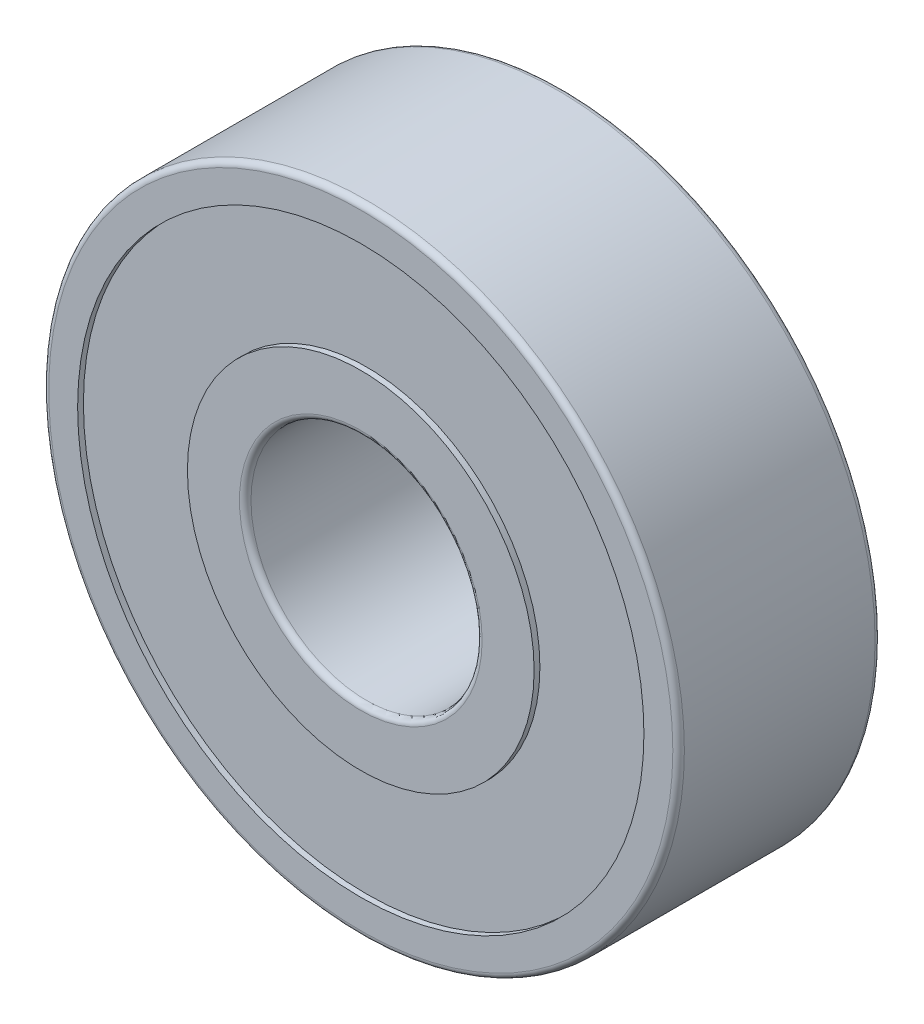
ISO-10303-21;
HEADER;
FILE_DESCRIPTION(('STEP AP214'),'2;1');
FILE_NAME('part.step','',(''),(''),'','','');
FILE_SCHEMA(('AUTOMOTIVE_DESIGN { 1 0 10303 214 1 1 1 1 }'));
ENDSEC;
DATA;
#1=APPLICATION_CONTEXT('core data for automotive mechanical design processes');
#2=APPLICATION_PROTOCOL_DEFINITION('international standard','automotive_design',2000,#1);
#3=PRODUCT_CONTEXT('',#1,'mechanical');
#4=PRODUCT('Part','Part','',(#3));
#5=PRODUCT_RELATED_PRODUCT_CATEGORY('part','',(#4));
#6=PRODUCT_DEFINITION_FORMATION('','',#4);
#7=PRODUCT_DEFINITION_CONTEXT('part definition',#1,'design');
#8=PRODUCT_DEFINITION('design','',#6,#7);
#9=PRODUCT_DEFINITION_SHAPE('','',#8);
#10=(LENGTH_UNIT() NAMED_UNIT(*) SI_UNIT(.MILLI.,.METRE.));
#11=(NAMED_UNIT(*) PLANE_ANGLE_UNIT() SI_UNIT($,.RADIAN.));
#12=(NAMED_UNIT(*) SI_UNIT($,.STERADIAN.) SOLID_ANGLE_UNIT());
#13=UNCERTAINTY_MEASURE_WITH_UNIT(LENGTH_MEASURE(1.E-05),#10,'distance_accuracy_value','');
#14=(GEOMETRIC_REPRESENTATION_CONTEXT(3) GLOBAL_UNCERTAINTY_ASSIGNED_CONTEXT((#13)) GLOBAL_UNIT_ASSIGNED_CONTEXT((#10,
#11,#12)) REPRESENTATION_CONTEXT('',''));
#15=CARTESIAN_POINT('',(0.,0.,0.));
#16=DIRECTION('',(0.,0.,1.));
#17=DIRECTION('',(1.,0.,0.));
#18=AXIS2_PLACEMENT_3D('',#15,#16,#17);
#19=CARTESIAN_POINT('',(0.,0.,0.));
#20=DIRECTION('',(0.,0.,-1.));
#21=DIRECTION('',(1.,0.,0.));
#22=AXIS2_PLACEMENT_3D('',#19,#20,#21);
#23=PLANE('',#22);
#24=CARTESIAN_POINT('',(0.,0.,0.));
#25=DIRECTION('',(0.,0.,1.));
#26=DIRECTION('',(1.,0.,0.));
#27=AXIS2_PLACEMENT_3D('',#24,#25,#26);
#28=CIRCLE('',#27,4.2);
#29=CARTESIAN_POINT('',(4.2,0.,0.));
#30=VERTEX_POINT('',#29);
#31=EDGE_CURVE('E64',#30,#30,#28,.T.);
#32=ORIENTED_EDGE('',*,*,#31,.F.);
#33=EDGE_LOOP('',(#32));
#34=FACE_BOUND('',#33,.T.);
#35=CARTESIAN_POINT('',(0.,0.,0.));
#36=DIRECTION('',(0.,0.,1.));
#37=DIRECTION('',(1.,0.,0.));
#38=AXIS2_PLACEMENT_3D('',#35,#36,#37);
#39=CIRCLE('',#38,6.);
#40=CARTESIAN_POINT('',(6.,0.,0.));
#41=VERTEX_POINT('',#40);
#42=EDGE_CURVE('E86',#41,#41,#39,.T.);
#43=ORIENTED_EDGE('',*,*,#42,.T.);
#44=EDGE_LOOP('',(#43));
#45=FACE_BOUND('',#44,.T.);
#46=ADVANCED_FACE('F35',(#34,#45),#23,.F.);
#47=CARTESIAN_POINT('',(0.,0.,-7.));
#48=DIRECTION('',(0.,0.,-1.));
#49=DIRECTION('',(1.,0.,0.));
#50=AXIS2_PLACEMENT_3D('',#47,#48,#49);
#51=PLANE('',#50);
#52=CARTESIAN_POINT('',(0.,0.,-7.));
#53=DIRECTION('',(0.,0.,1.));
#54=DIRECTION('',(1.,0.,0.));
#55=AXIS2_PLACEMENT_3D('',#52,#53,#54);
#56=CIRCLE('',#55,4.2);
#57=CARTESIAN_POINT('',(4.2,0.,-7.));
#58=VERTEX_POINT('',#57);
#59=EDGE_CURVE('E55',#58,#58,#56,.F.);
#60=ORIENTED_EDGE('',*,*,#59,.F.);
#61=EDGE_LOOP('',(#60));
#62=FACE_BOUND('',#61,.T.);
#63=CARTESIAN_POINT('',(0.,0.,-7.));
#64=DIRECTION('',(0.,0.,1.));
#65=DIRECTION('',(1.,0.,0.));
#66=AXIS2_PLACEMENT_3D('',#63,#64,#65);
#67=CIRCLE('',#66,6.);
#68=CARTESIAN_POINT('',(6.,0.,-7.));
#69=VERTEX_POINT('',#68);
#70=EDGE_CURVE('E74',#69,#69,#67,.T.);
#71=ORIENTED_EDGE('',*,*,#70,.F.);
#72=EDGE_LOOP('',(#71));
#73=FACE_BOUND('',#72,.T.);
#74=ADVANCED_FACE('F112',(#62,#73),#51,.T.);
#75=CARTESIAN_POINT('',(0.,0.,-7.));
#76=DIRECTION('',(0.,0.,1.));
#77=DIRECTION('',(1.,0.,0.));
#78=AXIS2_PLACEMENT_3D('',#75,#76,#77);
#79=CIRCLE('',#78,10.8);
#80=CARTESIAN_POINT('',(10.8,0.,-7.));
#81=VERTEX_POINT('',#80);
#82=EDGE_CURVE('E10',#81,#81,#79,.T.);
#83=ORIENTED_EDGE('',*,*,#82,.F.);
#84=EDGE_LOOP('',(#83));
#85=FACE_BOUND('',#84,.T.);
#86=CARTESIAN_POINT('',(0.,0.,-7.));
#87=DIRECTION('',(0.,0.,1.));
#88=DIRECTION('',(1.,0.,0.));
#89=AXIS2_PLACEMENT_3D('',#86,#87,#88);
#90=CIRCLE('',#89,9.8);
#91=CARTESIAN_POINT('',(9.8,0.,-7.));
#92=VERTEX_POINT('',#91);
#93=EDGE_CURVE('E68',#92,#92,#90,.T.);
#94=ORIENTED_EDGE('',*,*,#93,.T.);
#95=EDGE_LOOP('',(#94));
#96=FACE_BOUND('',#95,.T.);
#97=ADVANCED_FACE('F119',(#85,#96),#51,.T.);
#98=CARTESIAN_POINT('',(0.,0.,0.));
#99=DIRECTION('',(0.,0.,1.));
#100=DIRECTION('',(1.,0.,0.));
#101=AXIS2_PLACEMENT_3D('',#98,#99,#100);
#102=CIRCLE('',#101,10.8);
#103=CARTESIAN_POINT('',(10.8,0.,0.));
#104=VERTEX_POINT('',#103);
#105=EDGE_CURVE('E42',#104,#104,#102,.F.);
#106=ORIENTED_EDGE('',*,*,#105,.F.);
#107=EDGE_LOOP('',(#106));
#108=FACE_BOUND('',#107,.T.);
#109=CARTESIAN_POINT('',(0.,0.,0.));
#110=DIRECTION('',(0.,0.,1.));
#111=DIRECTION('',(1.,0.,0.));
#112=AXIS2_PLACEMENT_3D('',#109,#110,#111);
#113=CIRCLE('',#112,9.8);
#114=CARTESIAN_POINT('',(9.8,0.,0.));
#115=VERTEX_POINT('',#114);
#116=EDGE_CURVE('E80',#115,#115,#113,.T.);
#117=ORIENTED_EDGE('',*,*,#116,.F.);
#118=EDGE_LOOP('',(#117));
#119=FACE_BOUND('',#118,.T.);
#120=ADVANCED_FACE('F115',(#108,#119),#23,.F.);
#121=CARTESIAN_POINT('',(0.,0.,-7.));
#122=DIRECTION('',(0.,0.,1.));
#123=DIRECTION('',(-1.,0.,0.));
#124=AXIS2_PLACEMENT_3D('',#121,#122,#123);
#125=CYLINDRICAL_SURFACE('',#124,11.);
#126=CARTESIAN_POINT('',(0.,0.,-0.2));
#127=DIRECTION('',(0.,0.,1.));
#128=DIRECTION('',(1.,0.,0.));
#129=AXIS2_PLACEMENT_3D('',#126,#127,#128);
#130=CIRCLE('',#129,11.);
#131=CARTESIAN_POINT('',(11.,0.,-0.2));
#132=VERTEX_POINT('',#131);
#133=EDGE_CURVE('E46',#132,#132,#130,.T.);
#134=ORIENTED_EDGE('',*,*,#133,.F.);
#135=EDGE_LOOP('',(#134));
#136=FACE_BOUND('',#135,.T.);
#137=CARTESIAN_POINT('',(0.,0.,-6.8));
#138=DIRECTION('',(0.,0.,1.));
#139=DIRECTION('',(1.,0.,0.));
#140=AXIS2_PLACEMENT_3D('',#137,#138,#139);
#141=CIRCLE('',#140,11.);
#142=CARTESIAN_POINT('',(11.,0.,-6.8));
#143=VERTEX_POINT('',#142);
#144=EDGE_CURVE('E50',#143,#143,#141,.F.);
#145=ORIENTED_EDGE('',*,*,#144,.F.);
#146=EDGE_LOOP('',(#145));
#147=FACE_BOUND('',#146,.T.);
#148=ADVANCED_FACE('F126',(#136,#147),#125,.T.);
#149=CARTESIAN_POINT('',(0.,0.,-7.));
#150=DIRECTION('',(0.,0.,1.));
#151=DIRECTION('',(-1.,0.,0.));
#152=AXIS2_PLACEMENT_3D('',#149,#150,#151);
#153=CYLINDRICAL_SURFACE('',#152,4.);
#154=CARTESIAN_POINT('',(0.,0.,-0.2));
#155=DIRECTION('',(0.,0.,1.));
#156=DIRECTION('',(1.,0.,0.));
#157=AXIS2_PLACEMENT_3D('',#154,#155,#156);
#158=CIRCLE('',#157,4.);
#159=CARTESIAN_POINT('',(4.,0.,-0.2));
#160=VERTEX_POINT('',#159);
#161=EDGE_CURVE('E58',#160,#160,#158,.F.);
#162=ORIENTED_EDGE('',*,*,#161,.F.);
#163=EDGE_LOOP('',(#162));
#164=FACE_BOUND('',#163,.T.);
#165=CARTESIAN_POINT('',(0.,0.,-6.8));
#166=DIRECTION('',(0.,0.,1.));
#167=DIRECTION('',(1.,0.,0.));
#168=AXIS2_PLACEMENT_3D('',#165,#166,#167);
#169=CIRCLE('',#168,4.);
#170=CARTESIAN_POINT('',(4.,0.,-6.8));
#171=VERTEX_POINT('',#170);
#172=EDGE_CURVE('E61',#171,#171,#169,.T.);
#173=ORIENTED_EDGE('',*,*,#172,.F.);
#174=EDGE_LOOP('',(#173));
#175=FACE_BOUND('',#174,.T.);
#176=ADVANCED_FACE('F132',(#164,#175),#153,.F.);
#177=CARTESIAN_POINT('',(0.,0.,-6.8));
#178=DIRECTION('',(0.,0.,-1.));
#179=DIRECTION('',(1.,0.,0.));
#180=AXIS2_PLACEMENT_3D('',#177,#178,#179);
#181=CYLINDRICAL_SURFACE('',#180,9.8);
#182=CARTESIAN_POINT('',(0.,0.,-6.8));
#183=DIRECTION('',(0.,0.,1.));
#184=DIRECTION('',(1.,0.,0.));
#185=AXIS2_PLACEMENT_3D('',#182,#183,#184);
#186=CIRCLE('',#185,9.8);
#187=CARTESIAN_POINT('',(9.8,0.,-6.8));
#188=VERTEX_POINT('',#187);
#189=EDGE_CURVE('E67',#188,#188,#186,.T.);
#190=ORIENTED_EDGE('',*,*,#189,.T.);
#191=EDGE_LOOP('',(#190));
#192=FACE_BOUND('',#191,.T.);
#193=ORIENTED_EDGE('',*,*,#93,.F.);
#194=EDGE_LOOP('',(#193));
#195=FACE_BOUND('',#194,.T.);
#196=ADVANCED_FACE('F144',(#192,#195),#181,.F.);
#197=CARTESIAN_POINT('',(0.,0.,-6.8));
#198=DIRECTION('',(0.,0.,-1.));
#199=DIRECTION('',(1.,0.,0.));
#200=AXIS2_PLACEMENT_3D('',#197,#198,#199);
#201=PLANE('',#200);
#202=CARTESIAN_POINT('',(0.,0.,-6.8));
#203=DIRECTION('',(0.,0.,1.));
#204=DIRECTION('',(1.,0.,0.));
#205=AXIS2_PLACEMENT_3D('',#202,#203,#204);
#206=CIRCLE('',#205,6.);
#207=CARTESIAN_POINT('',(6.,0.,-6.8));
#208=VERTEX_POINT('',#207);
#209=EDGE_CURVE('E71',#208,#208,#206,.T.);
#210=ORIENTED_EDGE('',*,*,#209,.T.);
#211=EDGE_LOOP('',(#210));
#212=FACE_BOUND('',#211,.T.);
#213=ORIENTED_EDGE('',*,*,#189,.F.);
#214=EDGE_LOOP('',(#213));
#215=FACE_BOUND('',#214,.T.);
#216=ADVANCED_FACE('F107',(#212,#215),#201,.T.);
#217=CARTESIAN_POINT('',(0.,0.,-6.8));
#218=DIRECTION('',(0.,0.,-1.));
#219=DIRECTION('',(1.,0.,0.));
#220=AXIS2_PLACEMENT_3D('',#217,#218,#219);
#221=CYLINDRICAL_SURFACE('',#220,6.);
#222=ORIENTED_EDGE('',*,*,#209,.F.);
#223=EDGE_LOOP('',(#222));
#224=FACE_BOUND('',#223,.T.);
#225=ORIENTED_EDGE('',*,*,#70,.T.);
#226=EDGE_LOOP('',(#225));
#227=FACE_BOUND('',#226,.T.);
#228=ADVANCED_FACE('F98',(#224,#227),#221,.T.);
#229=CARTESIAN_POINT('',(0.,0.,-0.2));
#230=DIRECTION('',(0.,0.,1.));
#231=DIRECTION('',(1.,0.,0.));
#232=AXIS2_PLACEMENT_3D('',#229,#230,#231);
#233=PLANE('',#232);
#234=CARTESIAN_POINT('',(0.,0.,-0.2));
#235=DIRECTION('',(0.,0.,1.));
#236=DIRECTION('',(1.,0.,0.));
#237=AXIS2_PLACEMENT_3D('',#234,#235,#236);
#238=CIRCLE('',#237,9.8);
#239=CARTESIAN_POINT('',(9.8,0.,-0.2));
#240=VERTEX_POINT('',#239);
#241=EDGE_CURVE('E77',#240,#240,#238,.T.);
#242=ORIENTED_EDGE('',*,*,#241,.T.);
#243=EDGE_LOOP('',(#242));
#244=FACE_BOUND('',#243,.T.);
#245=CARTESIAN_POINT('',(0.,0.,-0.2));
#246=DIRECTION('',(0.,0.,1.));
#247=DIRECTION('',(1.,0.,0.));
#248=AXIS2_PLACEMENT_3D('',#245,#246,#247);
#249=CIRCLE('',#248,6.);
#250=CARTESIAN_POINT('',(6.,0.,-0.2));
#251=VERTEX_POINT('',#250);
#252=EDGE_CURVE('E83',#251,#251,#249,.T.);
#253=ORIENTED_EDGE('',*,*,#252,.F.);
#254=EDGE_LOOP('',(#253));
#255=FACE_BOUND('',#254,.T.);
#256=ADVANCED_FACE('F95',(#244,#255),#233,.T.);
#257=CARTESIAN_POINT('',(0.,0.,-0.2));
#258=DIRECTION('',(0.,0.,1.));
#259=DIRECTION('',(-1.,0.,0.));
#260=AXIS2_PLACEMENT_3D('',#257,#258,#259);
#261=CYLINDRICAL_SURFACE('',#260,9.8);
#262=ORIENTED_EDGE('',*,*,#241,.F.);
#263=EDGE_LOOP('',(#262));
#264=FACE_BOUND('',#263,.T.);
#265=ORIENTED_EDGE('',*,*,#116,.T.);
#266=EDGE_LOOP('',(#265));
#267=FACE_BOUND('',#266,.T.);
#268=ADVANCED_FACE('F97',(#264,#267),#261,.F.);
#269=CARTESIAN_POINT('',(0.,0.,-0.2));
#270=DIRECTION('',(0.,0.,1.));
#271=DIRECTION('',(-1.,0.,0.));
#272=AXIS2_PLACEMENT_3D('',#269,#270,#271);
#273=CYLINDRICAL_SURFACE('',#272,6.);
#274=ORIENTED_EDGE('',*,*,#252,.T.);
#275=EDGE_LOOP('',(#274));
#276=FACE_BOUND('',#275,.T.);
#277=ORIENTED_EDGE('',*,*,#42,.F.);
#278=EDGE_LOOP('',(#277));
#279=FACE_BOUND('',#278,.T.);
#280=ADVANCED_FACE('F92',(#276,#279),#273,.T.);
#281=CARTESIAN_POINT('',(0.,0.,-0.2));
#282=DIRECTION('',(0.,0.,-1.));
#283=DIRECTION('',(1.,0.,0.));
#284=AXIS2_PLACEMENT_3D('',#281,#282,#283);
#285=TOROIDAL_SURFACE('',#284,4.2,0.2);
#286=ORIENTED_EDGE('',*,*,#161,.T.);
#287=EDGE_LOOP('',(#286));
#288=FACE_BOUND('',#287,.T.);
#289=ORIENTED_EDGE('',*,*,#31,.T.);
#290=EDGE_LOOP('',(#289));
#291=FACE_BOUND('',#290,.T.);
#292=ADVANCED_FACE('F190',(#288,#291),#285,.T.);
#293=CARTESIAN_POINT('',(0.,0.,-6.8));
#294=DIRECTION('',(0.,0.,-1.));
#295=DIRECTION('',(1.,0.,0.));
#296=AXIS2_PLACEMENT_3D('',#293,#294,#295);
#297=TOROIDAL_SURFACE('',#296,4.2,0.2);
#298=ORIENTED_EDGE('',*,*,#59,.T.);
#299=EDGE_LOOP('',(#298));
#300=FACE_BOUND('',#299,.T.);
#301=ORIENTED_EDGE('',*,*,#172,.T.);
#302=EDGE_LOOP('',(#301));
#303=FACE_BOUND('',#302,.T.);
#304=ADVANCED_FACE('F198',(#300,#303),#297,.T.);
#305=CARTESIAN_POINT('',(0.,0.,-0.2));
#306=DIRECTION('',(0.,0.,-1.));
#307=DIRECTION('',(1.,0.,0.));
#308=AXIS2_PLACEMENT_3D('',#305,#306,#307);
#309=TOROIDAL_SURFACE('',#308,10.8,0.2);
#310=ORIENTED_EDGE('',*,*,#105,.T.);
#311=EDGE_LOOP('',(#310));
#312=FACE_BOUND('',#311,.T.);
#313=ORIENTED_EDGE('',*,*,#133,.T.);
#314=EDGE_LOOP('',(#313));
#315=FACE_BOUND('',#314,.T.);
#316=ADVANCED_FACE('F208',(#312,#315),#309,.T.);
#317=CARTESIAN_POINT('',(0.,0.,-6.8));
#318=DIRECTION('',(0.,0.,-1.));
#319=DIRECTION('',(1.,0.,0.));
#320=AXIS2_PLACEMENT_3D('',#317,#318,#319);
#321=TOROIDAL_SURFACE('',#320,10.8,0.2);
#322=ORIENTED_EDGE('',*,*,#144,.T.);
#323=EDGE_LOOP('',(#322));
#324=FACE_BOUND('',#323,.T.);
#325=ORIENTED_EDGE('',*,*,#82,.T.);
#326=EDGE_LOOP('',(#325));
#327=FACE_BOUND('',#326,.T.);
#328=ADVANCED_FACE('F37',(#324,#327),#321,.T.);
#329=CLOSED_SHELL('',(#46,#74,#97,#120,#148,#176,#196,#216,#228,#256,#268,#280,#292,#304,#316,#328));
#330=MANIFOLD_SOLID_BREP('B2',#329);
#331=ADVANCED_BREP_SHAPE_REPRESENTATION('',(#18,#330),#14);
#332=SHAPE_DEFINITION_REPRESENTATION(#9,#331);
ENDSEC;
END-ISO-10303-21;
